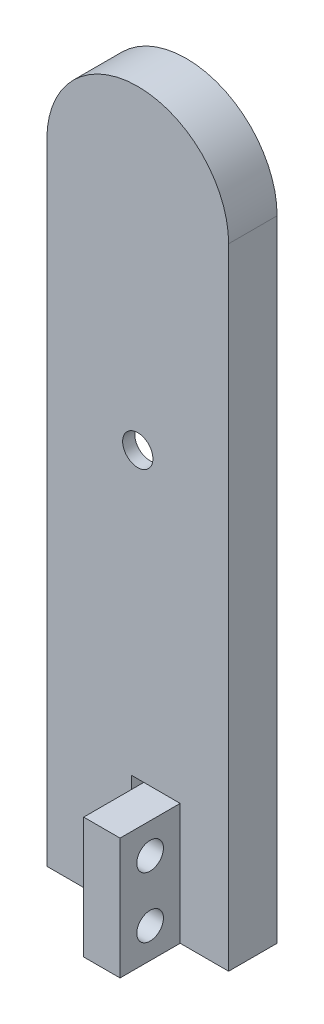
ISO-10303-21;
HEADER;
FILE_DESCRIPTION(('STEP AP214'),'2;1');
FILE_NAME('part.step','',(''),(''),'','','');
FILE_SCHEMA(('AUTOMOTIVE_DESIGN { 1 0 10303 214 1 1 1 1 }'));
ENDSEC;
DATA;
#1=APPLICATION_CONTEXT('core data for automotive mechanical design processes');
#2=APPLICATION_PROTOCOL_DEFINITION('international standard','automotive_design',2000,#1);
#3=PRODUCT_CONTEXT('',#1,'mechanical');
#4=PRODUCT('Part','Part','',(#3));
#5=PRODUCT_RELATED_PRODUCT_CATEGORY('part','',(#4));
#6=PRODUCT_DEFINITION_FORMATION('','',#4);
#7=PRODUCT_DEFINITION_CONTEXT('part definition',#1,'design');
#8=PRODUCT_DEFINITION('design','',#6,#7);
#9=PRODUCT_DEFINITION_SHAPE('','',#8);
#10=(LENGTH_UNIT() NAMED_UNIT(*) SI_UNIT(.MILLI.,.METRE.));
#11=(NAMED_UNIT(*) PLANE_ANGLE_UNIT() SI_UNIT($,.RADIAN.));
#12=(NAMED_UNIT(*) SI_UNIT($,.STERADIAN.) SOLID_ANGLE_UNIT());
#13=UNCERTAINTY_MEASURE_WITH_UNIT(LENGTH_MEASURE(1.E-05),#10,'distance_accuracy_value','');
#14=(GEOMETRIC_REPRESENTATION_CONTEXT(3) GLOBAL_UNCERTAINTY_ASSIGNED_CONTEXT((#13)) GLOBAL_UNIT_ASSIGNED_CONTEXT((#10,
#11,#12)) REPRESENTATION_CONTEXT('',''));
#15=CARTESIAN_POINT('',(0.,0.,0.));
#16=DIRECTION('',(0.,0.,1.));
#17=DIRECTION('',(1.,0.,0.));
#18=AXIS2_PLACEMENT_3D('',#15,#16,#17);
#19=CARTESIAN_POINT('',(0.,52.,4.));
#20=DIRECTION('',(0.,0.,1.));
#21=DIRECTION('',(1.,0.,0.));
#22=AXIS2_PLACEMENT_3D('',#19,#20,#21);
#23=PLANE('',#22);
#24=CARTESIAN_POINT('',(0.,33.5,4.));
#25=DIRECTION('',(0.,0.,1.));
#26=DIRECTION('',(1.,0.,0.));
#27=AXIS2_PLACEMENT_3D('',#24,#25,#26);
#28=CIRCLE('',#27,1.25);
#29=CARTESIAN_POINT('',(1.25,33.5,4.));
#30=VERTEX_POINT('',#29);
#31=EDGE_CURVE('E220',#30,#30,#28,.F.);
#32=ORIENTED_EDGE('',*,*,#31,.T.);
#33=EDGE_LOOP('',(#32));
#34=FACE_BOUND('',#33,.T.);
#35=DIRECTION('',(1.,0.,0.));
#36=VECTOR('',#35,1.);
#37=CARTESIAN_POINT('',(0.,10.,4.));
#38=LINE('',#37,#36);
#39=CARTESIAN_POINT('',(-0.499999999999999,10.,4.));
#40=VERTEX_POINT('',#39);
#41=CARTESIAN_POINT('',(0.499999999999999,10.,4.));
#42=VERTEX_POINT('',#41);
#43=EDGE_CURVE('E216',#40,#42,#38,.T.);
#44=ORIENTED_EDGE('',*,*,#43,.T.);
#45=DIRECTION('',(1.,0.,0.));
#46=VECTOR('',#45,1.);
#47=CARTESIAN_POINT('',(0.,10.,4.));
#48=LINE('',#47,#46);
#49=CARTESIAN_POINT('',(3.5,10.,4.));
#50=VERTEX_POINT('',#49);
#51=EDGE_CURVE('E57',#42,#50,#48,.T.);
#52=ORIENTED_EDGE('',*,*,#51,.T.);
#53=DIRECTION('',(0.,1.,0.));
#54=VECTOR('',#53,1.);
#55=CARTESIAN_POINT('',(3.5,52.,4.));
#56=LINE('',#55,#54);
#57=CARTESIAN_POINT('',(3.5,0.,4.));
#58=VERTEX_POINT('',#57);
#59=EDGE_CURVE('E11',#58,#50,#56,.T.);
#60=ORIENTED_EDGE('',*,*,#59,.F.);
#61=DIRECTION('',(1.,0.,0.));
#62=VECTOR('',#61,1.);
#63=CARTESIAN_POINT('',(7.5,0.,4.));
#64=LINE('',#63,#62);
#65=CARTESIAN_POINT('',(7.5,0.,4.));
#66=VERTEX_POINT('',#65);
#67=EDGE_CURVE('E161',#58,#66,#64,.T.);
#68=ORIENTED_EDGE('',*,*,#67,.T.);
#69=DIRECTION('',(0.,1.,0.));
#70=VECTOR('',#69,1.);
#71=CARTESIAN_POINT('',(7.5,0.,4.));
#72=LINE('',#71,#70);
#73=CARTESIAN_POINT('',(7.5,52.,4.));
#74=VERTEX_POINT('',#73);
#75=EDGE_CURVE('E291',#66,#74,#72,.T.);
#76=ORIENTED_EDGE('',*,*,#75,.T.);
#77=CARTESIAN_POINT('',(0.,52.,4.));
#78=DIRECTION('',(0.,0.,1.));
#79=DIRECTION('',(1.,0.,0.));
#80=AXIS2_PLACEMENT_3D('',#77,#78,#79);
#81=CIRCLE('',#80,7.5);
#82=CARTESIAN_POINT('',(-7.5,52.,4.));
#83=VERTEX_POINT('',#82);
#84=EDGE_CURVE('E294',#74,#83,#81,.T.);
#85=ORIENTED_EDGE('',*,*,#84,.T.);
#86=DIRECTION('',(0.,-1.,0.));
#87=VECTOR('',#86,1.);
#88=CARTESIAN_POINT('',(-7.5,0.,4.));
#89=LINE('',#88,#87);
#90=CARTESIAN_POINT('',(-7.5,0.,4.));
#91=VERTEX_POINT('',#90);
#92=EDGE_CURVE('E297',#83,#91,#89,.T.);
#93=ORIENTED_EDGE('',*,*,#92,.T.);
#94=CARTESIAN_POINT('',(-0.5,0.,4.));
#95=VERTEX_POINT('',#94);
#96=EDGE_CURVE('E287',#91,#95,#64,.T.);
#97=ORIENTED_EDGE('',*,*,#96,.T.);
#98=DIRECTION('',(0.,1.,0.));
#99=VECTOR('',#98,1.);
#100=CARTESIAN_POINT('',(-0.499999999999997,52.,4.));
#101=LINE('',#100,#99);
#102=EDGE_CURVE('E212',#95,#40,#101,.T.);
#103=ORIENTED_EDGE('',*,*,#102,.T.);
#104=EDGE_LOOP('',(#44,#52,#60,#68,#76,#85,#93,#97,#103));
#105=FACE_BOUND('',#104,.T.);
#106=ADVANCED_FACE('F39',(#34,#105),#23,.T.);
#107=CARTESIAN_POINT('',(7.5,0.,4.));
#108=DIRECTION('',(0.,1.,0.));
#109=DIRECTION('',(0.,0.,1.));
#110=AXIS2_PLACEMENT_3D('',#107,#108,#109);
#111=PLANE('',#110);
#112=DIRECTION('',(0.,0.,-1.));
#113=VECTOR('',#112,1.);
#114=CARTESIAN_POINT('',(0.5,0.,16.3));
#115=LINE('',#114,#113);
#116=CARTESIAN_POINT('',(0.5,0.,8.96178465974861));
#117=VERTEX_POINT('',#116);
#118=CARTESIAN_POINT('',(0.5,0.,0.));
#119=VERTEX_POINT('',#118);
#120=EDGE_CURVE('E209',#117,#119,#115,.T.);
#121=ORIENTED_EDGE('',*,*,#120,.T.);
#122=DIRECTION('',(1.,0.,0.));
#123=VECTOR('',#122,1.);
#124=CARTESIAN_POINT('',(7.5,0.,0.));
#125=LINE('',#124,#123);
#126=CARTESIAN_POINT('',(7.5,0.,0.));
#127=VERTEX_POINT('',#126);
#128=EDGE_CURVE('E286',#119,#127,#125,.T.);
#129=ORIENTED_EDGE('',*,*,#128,.T.);
#130=DIRECTION('',(0.,0.,-1.));
#131=VECTOR('',#130,1.);
#132=CARTESIAN_POINT('',(7.5,0.,4.));
#133=LINE('',#132,#131);
#134=EDGE_CURVE('E49',#66,#127,#133,.T.);
#135=ORIENTED_EDGE('',*,*,#134,.F.);
#136=ORIENTED_EDGE('',*,*,#67,.F.);
#137=DIRECTION('',(0.,0.,-1.));
#138=VECTOR('',#137,1.);
#139=CARTESIAN_POINT('',(3.5,0.,8.96178465974861));
#140=LINE('',#139,#138);
#141=CARTESIAN_POINT('',(3.5,0.,8.96178465974861));
#142=VERTEX_POINT('',#141);
#143=EDGE_CURVE('E155',#142,#58,#140,.T.);
#144=ORIENTED_EDGE('',*,*,#143,.F.);
#145=DIRECTION('',(-1.,0.,0.));
#146=VECTOR('',#145,1.);
#147=CARTESIAN_POINT('',(3.5,0.,8.96178465974861));
#148=LINE('',#147,#146);
#149=EDGE_CURVE('E158',#142,#117,#148,.T.);
#150=ORIENTED_EDGE('',*,*,#149,.T.);
#151=EDGE_LOOP('',(#121,#129,#135,#136,#144,#150));
#152=FACE_BOUND('',#151,.T.);
#153=ADVANCED_FACE('F41',(#152),#111,.F.);
#154=DIRECTION('',(0.,0.,-1.));
#155=VECTOR('',#154,1.);
#156=CARTESIAN_POINT('',(-0.5,0.,16.3));
#157=LINE('',#156,#155);
#158=CARTESIAN_POINT('',(-0.499999999999999,0.,0.));
#159=VERTEX_POINT('',#158);
#160=EDGE_CURVE('E200',#95,#159,#157,.T.);
#161=ORIENTED_EDGE('',*,*,#160,.F.);
#162=ORIENTED_EDGE('',*,*,#96,.F.);
#163=DIRECTION('',(0.,0.,-1.));
#164=VECTOR('',#163,1.);
#165=CARTESIAN_POINT('',(-7.5,0.,4.));
#166=LINE('',#165,#164);
#167=CARTESIAN_POINT('',(-7.5,0.,0.));
#168=VERTEX_POINT('',#167);
#169=EDGE_CURVE('E300',#91,#168,#166,.T.);
#170=ORIENTED_EDGE('',*,*,#169,.T.);
#171=EDGE_CURVE('E301',#168,#159,#125,.T.);
#172=ORIENTED_EDGE('',*,*,#171,.T.);
#173=EDGE_LOOP('',(#161,#162,#170,#172));
#174=FACE_BOUND('',#173,.T.);
#175=ADVANCED_FACE('F382',(#174),#111,.F.);
#176=CARTESIAN_POINT('',(0.,52.,0.));
#177=DIRECTION('',(0.,0.,1.));
#178=DIRECTION('',(1.,0.,0.));
#179=AXIS2_PLACEMENT_3D('',#176,#177,#178);
#180=PLANE('',#179);
#181=DIRECTION('',(-0.161684528353419,0.986842496699009,0.));
#182=VECTOR('',#181,1.);
#183=CARTESIAN_POINT('',(10.214455548325,1.67353902293651,0.));
#184=LINE('',#183,#182);
#185=CARTESIAN_POINT('',(5.,33.5,0.));
#186=VERTEX_POINT('',#185);
#187=CARTESIAN_POINT('',(2.29663575823377,50.,0.));
#188=VERTEX_POINT('',#187);
#189=EDGE_CURVE('E230',#186,#188,#184,.T.);
#190=ORIENTED_EDGE('',*,*,#189,.T.);
#191=CARTESIAN_POINT('',(0.,50.,0.));
#192=DIRECTION('',(0.,0.,1.));
#193=DIRECTION('',(1.,0.,0.));
#194=AXIS2_PLACEMENT_3D('',#191,#192,#193);
#195=CIRCLE('',#194,2.29663575823377);
#196=CARTESIAN_POINT('',(-2.29663575823377,50.,0.));
#197=VERTEX_POINT('',#196);
#198=EDGE_CURVE('E224',#197,#188,#195,.F.);
#199=ORIENTED_EDGE('',*,*,#198,.F.);
#200=DIRECTION('',(-0.161684528353419,-0.986842496699009,0.));
#201=VECTOR('',#200,1.);
#202=CARTESIAN_POINT('',(-10.214455548325,1.67353902293651,0.));
#203=LINE('',#202,#201);
#204=CARTESIAN_POINT('',(-5.,33.5,0.));
#205=VERTEX_POINT('',#204);
#206=EDGE_CURVE('E249',#197,#205,#203,.T.);
#207=ORIENTED_EDGE('',*,*,#206,.T.);
#208=DIRECTION('',(0.161380696641222,-0.986892228539466,0.));
#209=VECTOR('',#208,1.);
#210=CARTESIAN_POINT('',(0.465608050517505,0.0761381530640669,0.));
#211=LINE('',#210,#209);
#212=CARTESIAN_POINT('',(-2.30185179538713,17.,0.));
#213=VERTEX_POINT('',#212);
#214=EDGE_CURVE('E253',#205,#213,#211,.T.);
#215=ORIENTED_EDGE('',*,*,#214,.T.);
#216=CARTESIAN_POINT('',(0.,17.,0.));
#217=DIRECTION('',(0.,0.,1.));
#218=DIRECTION('',(1.,0.,0.));
#219=AXIS2_PLACEMENT_3D('',#216,#217,#218);
#220=CIRCLE('',#219,2.30185179538713);
#221=CARTESIAN_POINT('',(2.27233199291966,16.6325370741411,0.));
#222=VERTEX_POINT('',#221);
#223=EDGE_CURVE('E257',#213,#222,#220,.T.);
#224=ORIENTED_EDGE('',*,*,#223,.T.);
#225=DIRECTION('',(-0.159637960443524,-0.987175628541057,0.));
#226=VECTOR('',#225,1.);
#227=CARTESIAN_POINT('',(-0.40670997405777,0.0657698071887931,0.));
#228=LINE('',#227,#226);
#229=EDGE_CURVE('E261',#186,#222,#228,.T.);
#230=ORIENTED_EDGE('',*,*,#229,.F.);
#231=EDGE_LOOP('',(#190,#199,#207,#215,#224,#230));
#232=FACE_BOUND('',#231,.T.);
#233=DIRECTION('',(0.,1.,0.));
#234=VECTOR('',#233,1.);
#235=CARTESIAN_POINT('',(0.5,0.,0.));
#236=LINE('',#235,#234);
#237=CARTESIAN_POINT('',(0.499999999999999,10.,0.));
#238=VERTEX_POINT('',#237);
#239=EDGE_CURVE('E184',#119,#238,#236,.T.);
#240=ORIENTED_EDGE('',*,*,#239,.T.);
#241=DIRECTION('',(-1.,0.,0.));
#242=VECTOR('',#241,1.);
#243=CARTESIAN_POINT('',(0.499999999999999,10.,0.));
#244=LINE('',#243,#242);
#245=CARTESIAN_POINT('',(-0.499999999999999,10.,0.));
#246=VERTEX_POINT('',#245);
#247=EDGE_CURVE('E192',#238,#246,#244,.T.);
#248=ORIENTED_EDGE('',*,*,#247,.T.);
#249=DIRECTION('',(0.,-1.,0.));
#250=VECTOR('',#249,1.);
#251=CARTESIAN_POINT('',(-0.5,0.,0.));
#252=LINE('',#251,#250);
#253=EDGE_CURVE('E196',#246,#159,#252,.T.);
#254=ORIENTED_EDGE('',*,*,#253,.T.);
#255=ORIENTED_EDGE('',*,*,#171,.F.);
#256=DIRECTION('',(0.,-1.,0.));
#257=VECTOR('',#256,1.);
#258=CARTESIAN_POINT('',(-7.5,0.,0.));
#259=LINE('',#258,#257);
#260=CARTESIAN_POINT('',(-7.5,52.,0.));
#261=VERTEX_POINT('',#260);
#262=EDGE_CURVE('E311',#261,#168,#259,.T.);
#263=ORIENTED_EDGE('',*,*,#262,.F.);
#264=CARTESIAN_POINT('',(0.,52.,0.));
#265=DIRECTION('',(0.,0.,1.));
#266=DIRECTION('',(1.,0.,0.));
#267=AXIS2_PLACEMENT_3D('',#264,#265,#266);
#268=CIRCLE('',#267,7.5);
#269=CARTESIAN_POINT('',(7.5,52.,0.));
#270=VERTEX_POINT('',#269);
#271=EDGE_CURVE('E308',#270,#261,#268,.T.);
#272=ORIENTED_EDGE('',*,*,#271,.F.);
#273=DIRECTION('',(0.,1.,0.));
#274=VECTOR('',#273,1.);
#275=CARTESIAN_POINT('',(7.5,0.,0.));
#276=LINE('',#275,#274);
#277=EDGE_CURVE('E305',#127,#270,#276,.T.);
#278=ORIENTED_EDGE('',*,*,#277,.F.);
#279=ORIENTED_EDGE('',*,*,#128,.F.);
#280=EDGE_LOOP('',(#240,#248,#254,#255,#263,#272,#278,#279));
#281=FACE_BOUND('',#280,.T.);
#282=ADVANCED_FACE('F363',(#232,#281),#180,.F.);
#283=CARTESIAN_POINT('',(7.5,0.,4.));
#284=DIRECTION('',(-1.,0.,0.));
#285=DIRECTION('',(0.,0.,1.));
#286=AXIS2_PLACEMENT_3D('',#283,#284,#285);
#287=PLANE('',#286);
#288=ORIENTED_EDGE('',*,*,#277,.T.);
#289=DIRECTION('',(0.,0.,-1.));
#290=VECTOR('',#289,1.);
#291=CARTESIAN_POINT('',(7.5,52.,4.));
#292=LINE('',#291,#290);
#293=EDGE_CURVE('E321',#74,#270,#292,.T.);
#294=ORIENTED_EDGE('',*,*,#293,.F.);
#295=ORIENTED_EDGE('',*,*,#75,.F.);
#296=ORIENTED_EDGE('',*,*,#134,.T.);
#297=EDGE_LOOP('',(#288,#294,#295,#296));
#298=FACE_BOUND('',#297,.T.);
#299=ADVANCED_FACE('F368',(#298),#287,.F.);
#300=CARTESIAN_POINT('',(0.,52.,4.));
#301=DIRECTION('',(0.,0.,-1.));
#302=DIRECTION('',(-1.,0.,0.));
#303=AXIS2_PLACEMENT_3D('',#300,#301,#302);
#304=CYLINDRICAL_SURFACE('',#303,7.5);
#305=ORIENTED_EDGE('',*,*,#271,.T.);
#306=DIRECTION('',(0.,0.,-1.));
#307=VECTOR('',#306,1.);
#308=CARTESIAN_POINT('',(-7.5,52.,4.));
#309=LINE('',#308,#307);
#310=EDGE_CURVE('E317',#83,#261,#309,.T.);
#311=ORIENTED_EDGE('',*,*,#310,.F.);
#312=ORIENTED_EDGE('',*,*,#84,.F.);
#313=ORIENTED_EDGE('',*,*,#293,.T.);
#314=EDGE_LOOP('',(#305,#311,#312,#313));
#315=FACE_BOUND('',#314,.T.);
#316=ADVANCED_FACE('F375',(#315),#304,.T.);
#317=CARTESIAN_POINT('',(-7.5,0.,4.));
#318=DIRECTION('',(1.,0.,0.));
#319=DIRECTION('',(0.,0.,-1.));
#320=AXIS2_PLACEMENT_3D('',#317,#318,#319);
#321=PLANE('',#320);
#322=ORIENTED_EDGE('',*,*,#262,.T.);
#323=ORIENTED_EDGE('',*,*,#169,.F.);
#324=ORIENTED_EDGE('',*,*,#92,.F.);
#325=ORIENTED_EDGE('',*,*,#310,.T.);
#326=EDGE_LOOP('',(#322,#323,#324,#325));
#327=FACE_BOUND('',#326,.T.);
#328=ADVANCED_FACE('F377',(#327),#321,.F.);
#329=CARTESIAN_POINT('',(0.,50.,3.));
#330=DIRECTION('',(0.,0.,-1.));
#331=DIRECTION('',(-1.,0.,0.));
#332=AXIS2_PLACEMENT_3D('',#329,#330,#331);
#333=CYLINDRICAL_SURFACE('',#332,2.29663575823377);
#334=ORIENTED_EDGE('',*,*,#198,.T.);
#335=DIRECTION('',(0.,0.,-1.));
#336=VECTOR('',#335,1.);
#337=CARTESIAN_POINT('',(2.29663575823377,50.,3.));
#338=LINE('',#337,#336);
#339=CARTESIAN_POINT('',(2.29663575823377,50.,3.));
#340=VERTEX_POINT('',#339);
#341=EDGE_CURVE('E246',#340,#188,#338,.T.);
#342=ORIENTED_EDGE('',*,*,#341,.F.);
#343=CARTESIAN_POINT('',(0.,50.,3.));
#344=DIRECTION('',(0.,0.,1.));
#345=DIRECTION('',(1.,0.,0.));
#346=AXIS2_PLACEMENT_3D('',#343,#344,#345);
#347=CIRCLE('',#346,2.29663575823377);
#348=CARTESIAN_POINT('',(-2.29663575823377,50.,3.));
#349=VERTEX_POINT('',#348);
#350=EDGE_CURVE('E225',#349,#340,#347,.F.);
#351=ORIENTED_EDGE('',*,*,#350,.F.);
#352=DIRECTION('',(0.,0.,-1.));
#353=VECTOR('',#352,1.);
#354=CARTESIAN_POINT('',(-2.29663575823377,50.,3.));
#355=LINE('',#354,#353);
#356=EDGE_CURVE('E283',#349,#197,#355,.T.);
#357=ORIENTED_EDGE('',*,*,#356,.T.);
#358=EDGE_LOOP('',(#334,#342,#351,#357));
#359=FACE_BOUND('',#358,.T.);
#360=ADVANCED_FACE('F407',(#359),#333,.F.);
#361=CARTESIAN_POINT('',(-10.214455548325,1.67353902293651,3.));
#362=DIRECTION('',(0.986842496699008,-0.161684528353419,0.));
#363=DIRECTION('',(0.161684528353419,0.986842496699008,0.));
#364=AXIS2_PLACEMENT_3D('',#361,#362,#363);
#365=PLANE('',#364);
#366=ORIENTED_EDGE('',*,*,#206,.F.);
#367=ORIENTED_EDGE('',*,*,#356,.F.);
#368=DIRECTION('',(-0.161684528353419,-0.986842496699009,0.));
#369=VECTOR('',#368,1.);
#370=CARTESIAN_POINT('',(-10.214455548325,1.67353902293651,3.));
#371=LINE('',#370,#369);
#372=CARTESIAN_POINT('',(-5.,33.5,3.));
#373=VERTEX_POINT('',#372);
#374=EDGE_CURVE('E229',#349,#373,#371,.T.);
#375=ORIENTED_EDGE('',*,*,#374,.T.);
#376=DIRECTION('',(0.,0.,-1.));
#377=VECTOR('',#376,1.);
#378=CARTESIAN_POINT('',(-5.,33.5,3.));
#379=LINE('',#378,#377);
#380=EDGE_CURVE('E280',#373,#205,#379,.T.);
#381=ORIENTED_EDGE('',*,*,#380,.T.);
#382=EDGE_LOOP('',(#366,#367,#375,#381));
#383=FACE_BOUND('',#382,.T.);
#384=ADVANCED_FACE('F435',(#383),#365,.T.);
#385=CARTESIAN_POINT('',(0.465608050517505,0.0761381530640669,3.));
#386=DIRECTION('',(0.986892228539466,0.161380696641222,0.));
#387=DIRECTION('',(-0.161380696641222,0.986892228539466,0.));
#388=AXIS2_PLACEMENT_3D('',#385,#386,#387);
#389=PLANE('',#388);
#390=ORIENTED_EDGE('',*,*,#214,.F.);
#391=ORIENTED_EDGE('',*,*,#380,.F.);
#392=DIRECTION('',(0.161380696641222,-0.986892228539466,0.));
#393=VECTOR('',#392,1.);
#394=CARTESIAN_POINT('',(0.465608050517505,0.0761381530640669,3.));
#395=LINE('',#394,#393);
#396=CARTESIAN_POINT('',(-2.30185179538713,17.,3.));
#397=VERTEX_POINT('',#396);
#398=EDGE_CURVE('E233',#373,#397,#395,.T.);
#399=ORIENTED_EDGE('',*,*,#398,.T.);
#400=DIRECTION('',(0.,0.,-1.));
#401=VECTOR('',#400,1.);
#402=CARTESIAN_POINT('',(-2.30185179538713,17.,3.));
#403=LINE('',#402,#401);
#404=EDGE_CURVE('E277',#397,#213,#403,.T.);
#405=ORIENTED_EDGE('',*,*,#404,.T.);
#406=EDGE_LOOP('',(#390,#391,#399,#405));
#407=FACE_BOUND('',#406,.T.);
#408=ADVANCED_FACE('F442',(#407),#389,.T.);
#409=CARTESIAN_POINT('',(0.,17.,3.));
#410=DIRECTION('',(0.,0.,-1.));
#411=DIRECTION('',(-1.,0.,0.));
#412=AXIS2_PLACEMENT_3D('',#409,#410,#411);
#413=CYLINDRICAL_SURFACE('',#412,2.30185179538713);
#414=ORIENTED_EDGE('',*,*,#223,.F.);
#415=ORIENTED_EDGE('',*,*,#404,.F.);
#416=CARTESIAN_POINT('',(0.,17.,3.));
#417=DIRECTION('',(0.,0.,1.));
#418=DIRECTION('',(1.,0.,0.));
#419=AXIS2_PLACEMENT_3D('',#416,#417,#418);
#420=CIRCLE('',#419,2.30185179538713);
#421=CARTESIAN_POINT('',(2.27233199291966,16.6325370741411,3.));
#422=VERTEX_POINT('',#421);
#423=EDGE_CURVE('E236',#397,#422,#420,.T.);
#424=ORIENTED_EDGE('',*,*,#423,.T.);
#425=DIRECTION('',(0.,0.,-1.));
#426=VECTOR('',#425,1.);
#427=CARTESIAN_POINT('',(2.27233199291966,16.6325370741411,3.));
#428=LINE('',#427,#426);
#429=EDGE_CURVE('E274',#422,#222,#428,.T.);
#430=ORIENTED_EDGE('',*,*,#429,.T.);
#431=EDGE_LOOP('',(#414,#415,#424,#430));
#432=FACE_BOUND('',#431,.T.);
#433=ADVANCED_FACE('F449',(#432),#413,.F.);
#434=CARTESIAN_POINT('',(-0.40670997405777,0.0657698071887931,3.));
#435=DIRECTION('',(0.987175628541057,-0.159637960443524,0.));
#436=DIRECTION('',(0.159637960443524,0.987175628541057,0.));
#437=AXIS2_PLACEMENT_3D('',#434,#435,#436);
#438=PLANE('',#437);
#439=ORIENTED_EDGE('',*,*,#229,.T.);
#440=ORIENTED_EDGE('',*,*,#429,.F.);
#441=DIRECTION('',(-0.159637960443524,-0.987175628541057,0.));
#442=VECTOR('',#441,1.);
#443=CARTESIAN_POINT('',(-0.40670997405777,0.0657698071887931,3.));
#444=LINE('',#443,#442);
#445=CARTESIAN_POINT('',(5.,33.5,3.));
#446=VERTEX_POINT('',#445);
#447=EDGE_CURVE('E239',#446,#422,#444,.T.);
#448=ORIENTED_EDGE('',*,*,#447,.F.);
#449=DIRECTION('',(0.,0.,-1.));
#450=VECTOR('',#449,1.);
#451=CARTESIAN_POINT('',(5.,33.5,3.));
#452=LINE('',#451,#450);
#453=EDGE_CURVE('E271',#446,#186,#452,.T.);
#454=ORIENTED_EDGE('',*,*,#453,.T.);
#455=EDGE_LOOP('',(#439,#440,#448,#454));
#456=FACE_BOUND('',#455,.T.);
#457=ADVANCED_FACE('F457',(#456),#438,.F.);
#458=CARTESIAN_POINT('',(10.214455548325,1.67353902293651,3.));
#459=DIRECTION('',(-0.986842496699008,-0.161684528353419,0.));
#460=DIRECTION('',(0.161684528353419,-0.986842496699008,0.));
#461=AXIS2_PLACEMENT_3D('',#458,#459,#460);
#462=PLANE('',#461);
#463=ORIENTED_EDGE('',*,*,#189,.F.);
#464=ORIENTED_EDGE('',*,*,#453,.F.);
#465=DIRECTION('',(-0.161684528353419,0.986842496699009,0.));
#466=VECTOR('',#465,1.);
#467=CARTESIAN_POINT('',(10.214455548325,1.67353902293651,3.));
#468=LINE('',#467,#466);
#469=EDGE_CURVE('E243',#446,#340,#468,.T.);
#470=ORIENTED_EDGE('',*,*,#469,.T.);
#471=ORIENTED_EDGE('',*,*,#341,.T.);
#472=EDGE_LOOP('',(#463,#464,#470,#471));
#473=FACE_BOUND('',#472,.T.);
#474=ADVANCED_FACE('F465',(#473),#462,.T.);
#475=CARTESIAN_POINT('',(0.,0.,3.));
#476=DIRECTION('',(0.,0.,1.));
#477=DIRECTION('',(1.,0.,0.));
#478=AXIS2_PLACEMENT_3D('',#475,#476,#477);
#479=PLANE('',#478);
#480=CARTESIAN_POINT('',(0.,33.5,3.));
#481=DIRECTION('',(0.,0.,1.));
#482=DIRECTION('',(1.,0.,0.));
#483=AXIS2_PLACEMENT_3D('',#480,#481,#482);
#484=CIRCLE('',#483,1.25);
#485=CARTESIAN_POINT('',(1.25,33.5,3.));
#486=VERTEX_POINT('',#485);
#487=EDGE_CURVE('E219',#486,#486,#484,.F.);
#488=ORIENTED_EDGE('',*,*,#487,.F.);
#489=EDGE_LOOP('',(#488));
#490=FACE_BOUND('',#489,.T.);
#491=ORIENTED_EDGE('',*,*,#350,.T.);
#492=ORIENTED_EDGE('',*,*,#469,.F.);
#493=ORIENTED_EDGE('',*,*,#447,.T.);
#494=ORIENTED_EDGE('',*,*,#423,.F.);
#495=ORIENTED_EDGE('',*,*,#398,.F.);
#496=ORIENTED_EDGE('',*,*,#374,.F.);
#497=EDGE_LOOP('',(#491,#492,#493,#494,#495,#496));
#498=FACE_BOUND('',#497,.T.);
#499=ADVANCED_FACE('F473',(#490,#498),#479,.F.);
#500=CARTESIAN_POINT('',(0.,33.5,12.4));
#501=DIRECTION('',(0.,0.,-1.));
#502=DIRECTION('',(-1.,0.,0.));
#503=AXIS2_PLACEMENT_3D('',#500,#501,#502);
#504=CYLINDRICAL_SURFACE('',#503,1.25);
#505=ORIENTED_EDGE('',*,*,#31,.F.);
#506=EDGE_LOOP('',(#505));
#507=FACE_BOUND('',#506,.T.);
#508=ORIENTED_EDGE('',*,*,#487,.T.);
#509=EDGE_LOOP('',(#508));
#510=FACE_BOUND('',#509,.T.);
#511=ADVANCED_FACE('F397',(#507,#510),#504,.F.);
#512=CARTESIAN_POINT('',(0.5,0.,16.3));
#513=DIRECTION('',(-1.,0.,0.));
#514=DIRECTION('',(0.,-1.,0.));
#515=AXIS2_PLACEMENT_3D('',#512,#513,#514);
#516=PLANE('',#515);
#517=CARTESIAN_POINT('',(0.5,7.5,6.48089232987431));
#518=DIRECTION('',(1.,0.,0.));
#519=DIRECTION('',(0.,0.,-1.));
#520=AXIS2_PLACEMENT_3D('',#517,#518,#519);
#521=CIRCLE('',#520,1.1);
#522=CARTESIAN_POINT('',(0.5,7.5,5.38089232987431));
#523=VERTEX_POINT('',#522);
#524=EDGE_CURVE('E333',#523,#523,#521,.T.);
#525=ORIENTED_EDGE('',*,*,#524,.T.);
#526=EDGE_LOOP('',(#525));
#527=FACE_BOUND('',#526,.T.);
#528=CARTESIAN_POINT('',(0.5,2.5,6.48089232987431));
#529=DIRECTION('',(1.,0.,0.));
#530=DIRECTION('',(0.,0.,1.));
#531=AXIS2_PLACEMENT_3D('',#528,#529,#530);
#532=CIRCLE('',#531,1.1);
#533=CARTESIAN_POINT('',(0.5,2.5,7.58089232987431));
#534=VERTEX_POINT('',#533);
#535=EDGE_CURVE('E340',#534,#534,#532,.T.);
#536=ORIENTED_EDGE('',*,*,#535,.T.);
#537=EDGE_LOOP('',(#536));
#538=FACE_BOUND('',#537,.T.);
#539=DIRECTION('',(0.,0.,-1.));
#540=VECTOR('',#539,1.);
#541=CARTESIAN_POINT('',(0.499999999999999,10.,16.3));
#542=LINE('',#541,#540);
#543=EDGE_CURVE('E206',#42,#238,#542,.T.);
#544=ORIENTED_EDGE('',*,*,#543,.T.);
#545=ORIENTED_EDGE('',*,*,#239,.F.);
#546=ORIENTED_EDGE('',*,*,#120,.F.);
#547=DIRECTION('',(0.,-1.,0.));
#548=VECTOR('',#547,1.);
#549=CARTESIAN_POINT('',(0.5,10.,8.96178465974861));
#550=LINE('',#549,#548);
#551=CARTESIAN_POINT('',(0.5,10.,8.96178465974861));
#552=VERTEX_POINT('',#551);
#553=EDGE_CURVE('E178',#552,#117,#550,.T.);
#554=ORIENTED_EDGE('',*,*,#553,.F.);
#555=DIRECTION('',(0.,0.,1.));
#556=VECTOR('',#555,1.);
#557=CARTESIAN_POINT('',(0.5,10.,8.96178465974861));
#558=LINE('',#557,#556);
#559=EDGE_CURVE('E174',#42,#552,#558,.T.);
#560=ORIENTED_EDGE('',*,*,#559,.F.);
#561=EDGE_LOOP('',(#544,#545,#546,#554,#560));
#562=FACE_BOUND('',#561,.T.);
#563=ADVANCED_FACE('F356',(#527,#538,#562),#516,.T.);
#564=CARTESIAN_POINT('',(0.499999999999999,10.,16.3));
#565=DIRECTION('',(0.,-1.,0.));
#566=DIRECTION('',(0.,0.,-1.));
#567=AXIS2_PLACEMENT_3D('',#564,#565,#566);
#568=PLANE('',#567);
#569=DIRECTION('',(0.,0.,-1.));
#570=VECTOR('',#569,1.);
#571=CARTESIAN_POINT('',(-0.499999999999999,10.,16.3));
#572=LINE('',#571,#570);
#573=EDGE_CURVE('E203',#40,#246,#572,.T.);
#574=ORIENTED_EDGE('',*,*,#573,.T.);
#575=ORIENTED_EDGE('',*,*,#247,.F.);
#576=ORIENTED_EDGE('',*,*,#543,.F.);
#577=ORIENTED_EDGE('',*,*,#43,.F.);
#578=EDGE_LOOP('',(#574,#575,#576,#577));
#579=FACE_BOUND('',#578,.T.);
#580=ADVANCED_FACE('F389',(#579),#568,.T.);
#581=CARTESIAN_POINT('',(-0.5,0.,16.3));
#582=DIRECTION('',(1.,0.,0.));
#583=DIRECTION('',(0.,1.,0.));
#584=AXIS2_PLACEMENT_3D('',#581,#582,#583);
#585=PLANE('',#584);
#586=ORIENTED_EDGE('',*,*,#160,.T.);
#587=ORIENTED_EDGE('',*,*,#253,.F.);
#588=ORIENTED_EDGE('',*,*,#573,.F.);
#589=ORIENTED_EDGE('',*,*,#102,.F.);
#590=EDGE_LOOP('',(#586,#587,#588,#589));
#591=FACE_BOUND('',#590,.T.);
#592=ADVANCED_FACE('F385',(#591),#585,.T.);
#593=CARTESIAN_POINT('',(3.5,10.,8.96178465974861));
#594=DIRECTION('',(0.,0.,-1.));
#595=DIRECTION('',(-1.,0.,0.));
#596=AXIS2_PLACEMENT_3D('',#593,#594,#595);
#597=PLANE('',#596);
#598=ORIENTED_EDGE('',*,*,#553,.T.);
#599=ORIENTED_EDGE('',*,*,#149,.F.);
#600=DIRECTION('',(0.,-1.,0.));
#601=VECTOR('',#600,1.);
#602=CARTESIAN_POINT('',(3.5,10.,8.96178465974861));
#603=LINE('',#602,#601);
#604=CARTESIAN_POINT('',(3.5,10.,8.96178465974861));
#605=VERTEX_POINT('',#604);
#606=EDGE_CURVE('E165',#605,#142,#603,.T.);
#607=ORIENTED_EDGE('',*,*,#606,.F.);
#608=DIRECTION('',(-1.,0.,0.));
#609=VECTOR('',#608,1.);
#610=CARTESIAN_POINT('',(3.5,10.,8.96178465974861));
#611=LINE('',#610,#609);
#612=EDGE_CURVE('E180',#605,#552,#611,.T.);
#613=ORIENTED_EDGE('',*,*,#612,.T.);
#614=EDGE_LOOP('',(#598,#599,#607,#613));
#615=FACE_BOUND('',#614,.T.);
#616=ADVANCED_FACE('F176',(#615),#597,.F.);
#617=CARTESIAN_POINT('',(3.5,10.,8.96178465974861));
#618=DIRECTION('',(0.,-1.,0.));
#619=DIRECTION('',(0.,0.,-1.));
#620=AXIS2_PLACEMENT_3D('',#617,#618,#619);
#621=PLANE('',#620);
#622=ORIENTED_EDGE('',*,*,#51,.F.);
#623=ORIENTED_EDGE('',*,*,#559,.T.);
#624=ORIENTED_EDGE('',*,*,#612,.F.);
#625=DIRECTION('',(0.,0.,1.));
#626=VECTOR('',#625,1.);
#627=CARTESIAN_POINT('',(3.5,10.,8.96178465974861));
#628=LINE('',#627,#626);
#629=EDGE_CURVE('E164',#50,#605,#628,.T.);
#630=ORIENTED_EDGE('',*,*,#629,.F.);
#631=EDGE_LOOP('',(#622,#623,#624,#630));
#632=FACE_BOUND('',#631,.T.);
#633=ADVANCED_FACE('F354',(#632),#621,.F.);
#634=CARTESIAN_POINT('',(3.5,0.,0.));
#635=DIRECTION('',(1.,0.,0.));
#636=DIRECTION('',(0.,0.,-1.));
#637=AXIS2_PLACEMENT_3D('',#634,#635,#636);
#638=PLANE('',#637);
#639=CARTESIAN_POINT('',(3.5,7.5,6.48089232987431));
#640=DIRECTION('',(1.,0.,0.));
#641=DIRECTION('',(0.,0.,-1.));
#642=AXIS2_PLACEMENT_3D('',#639,#640,#641);
#643=CIRCLE('',#642,1.1);
#644=CARTESIAN_POINT('',(3.5,7.5,5.38089232987431));
#645=VERTEX_POINT('',#644);
#646=EDGE_CURVE('E43',#645,#645,#643,.F.);
#647=ORIENTED_EDGE('',*,*,#646,.T.);
#648=EDGE_LOOP('',(#647));
#649=FACE_BOUND('',#648,.T.);
#650=CARTESIAN_POINT('',(3.5,2.5,6.48089232987431));
#651=DIRECTION('',(1.,0.,0.));
#652=DIRECTION('',(0.,0.,-1.));
#653=AXIS2_PLACEMENT_3D('',#650,#651,#652);
#654=CIRCLE('',#653,1.1);
#655=CARTESIAN_POINT('',(3.5,2.5,5.38089232987431));
#656=VERTEX_POINT('',#655);
#657=EDGE_CURVE('E330',#656,#656,#654,.F.);
#658=ORIENTED_EDGE('',*,*,#657,.T.);
#659=EDGE_LOOP('',(#658));
#660=FACE_BOUND('',#659,.T.);
#661=ORIENTED_EDGE('',*,*,#143,.T.);
#662=ORIENTED_EDGE('',*,*,#59,.T.);
#663=ORIENTED_EDGE('',*,*,#629,.T.);
#664=ORIENTED_EDGE('',*,*,#606,.T.);
#665=EDGE_LOOP('',(#661,#662,#663,#664));
#666=FACE_BOUND('',#665,.T.);
#667=ADVANCED_FACE('F168',(#649,#660,#666),#638,.T.);
#668=CARTESIAN_POINT('',(5.6,2.5,6.48089232987431));
#669=DIRECTION('',(-1.,0.,0.));
#670=DIRECTION('',(0.,0.,1.));
#671=AXIS2_PLACEMENT_3D('',#668,#669,#670);
#672=CYLINDRICAL_SURFACE('',#671,1.1);
#673=ORIENTED_EDGE('',*,*,#657,.F.);
#674=EDGE_LOOP('',(#673));
#675=FACE_BOUND('',#674,.T.);
#676=ORIENTED_EDGE('',*,*,#535,.F.);
#677=EDGE_LOOP('',(#676));
#678=FACE_BOUND('',#677,.T.);
#679=ADVANCED_FACE('F511',(#675,#678),#672,.F.);
#680=CARTESIAN_POINT('',(5.6,7.5,6.48089232987431));
#681=DIRECTION('',(-1.,0.,0.));
#682=DIRECTION('',(0.,0.,1.));
#683=AXIS2_PLACEMENT_3D('',#680,#681,#682);
#684=CYLINDRICAL_SURFACE('',#683,1.1);
#685=ORIENTED_EDGE('',*,*,#646,.F.);
#686=EDGE_LOOP('',(#685));
#687=FACE_BOUND('',#686,.T.);
#688=ORIENTED_EDGE('',*,*,#524,.F.);
#689=EDGE_LOOP('',(#688));
#690=FACE_BOUND('',#689,.T.);
#691=ADVANCED_FACE('F521',(#687,#690),#684,.F.);
#692=CLOSED_SHELL('',(#106,#153,#175,#282,#299,#316,#328,#360,#384,#408,#433,#457,#474,#499,
#511,#563,#580,#592,#616,#633,#667,#679,#691));
#693=MANIFOLD_SOLID_BREP('B2',#692);
#694=ADVANCED_BREP_SHAPE_REPRESENTATION('',(#18,#693),#14);
#695=SHAPE_DEFINITION_REPRESENTATION(#9,#694);
ENDSEC;
END-ISO-10303-21;
